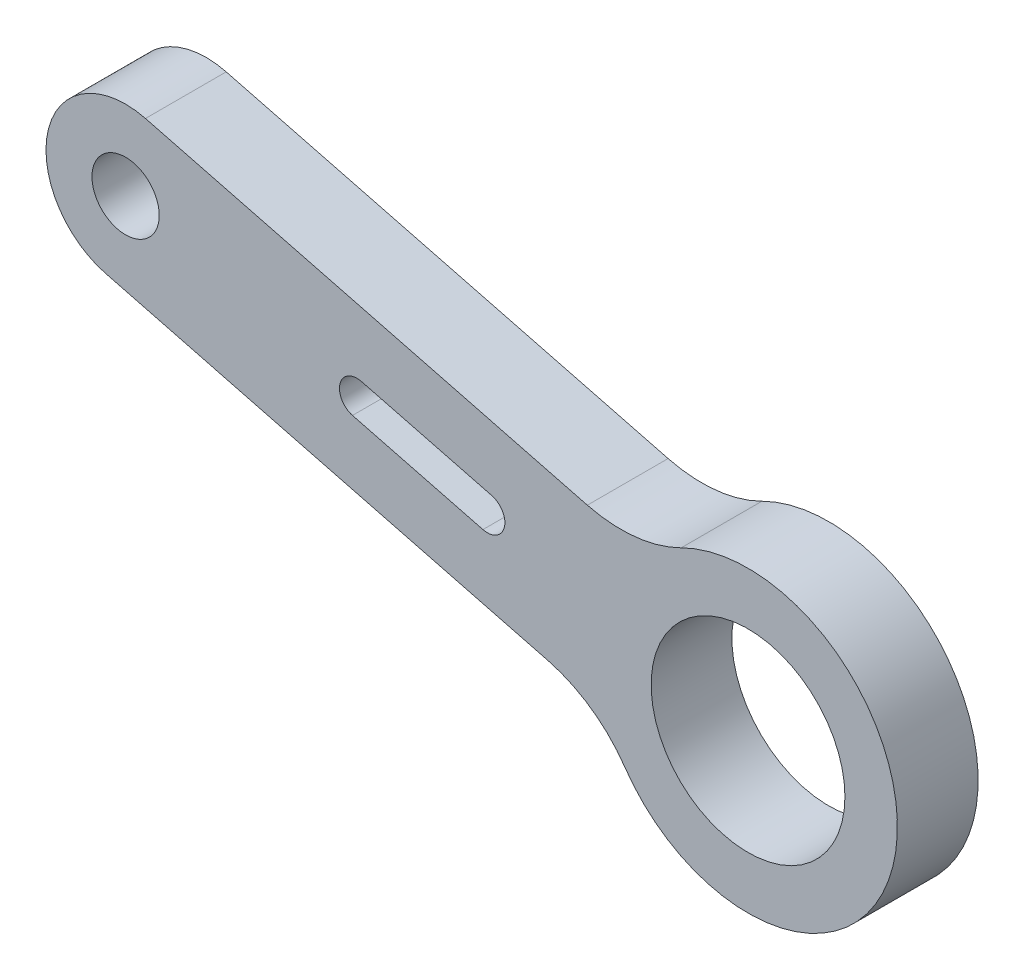
ISO-10303-21;
HEADER;
FILE_DESCRIPTION(('STEP AP214'),'2;1');
FILE_NAME('part.step','',(''),(''),'','','');
FILE_SCHEMA(('AUTOMOTIVE_DESIGN { 1 0 10303 214 1 1 1 1 }'));
ENDSEC;
DATA;
#1=APPLICATION_CONTEXT('core data for automotive mechanical design processes');
#2=APPLICATION_PROTOCOL_DEFINITION('international standard','automotive_design',2000,#1);
#3=PRODUCT_CONTEXT('',#1,'mechanical');
#4=PRODUCT('Part','Part','',(#3));
#5=PRODUCT_RELATED_PRODUCT_CATEGORY('part','',(#4));
#6=PRODUCT_DEFINITION_FORMATION('','',#4);
#7=PRODUCT_DEFINITION_CONTEXT('part definition',#1,'design');
#8=PRODUCT_DEFINITION('design','',#6,#7);
#9=PRODUCT_DEFINITION_SHAPE('','',#8);
#10=(LENGTH_UNIT() NAMED_UNIT(*) SI_UNIT(.MILLI.,.METRE.));
#11=(NAMED_UNIT(*) PLANE_ANGLE_UNIT() SI_UNIT($,.RADIAN.));
#12=(NAMED_UNIT(*) SI_UNIT($,.STERADIAN.) SOLID_ANGLE_UNIT());
#13=UNCERTAINTY_MEASURE_WITH_UNIT(LENGTH_MEASURE(1.E-05),#10,'distance_accuracy_value','');
#14=(GEOMETRIC_REPRESENTATION_CONTEXT(3) GLOBAL_UNCERTAINTY_ASSIGNED_CONTEXT((#13)) GLOBAL_UNIT_ASSIGNED_CONTEXT((#10,
#11,#12)) REPRESENTATION_CONTEXT('',''));
#15=CARTESIAN_POINT('',(0.,0.,0.));
#16=DIRECTION('',(0.,0.,1.));
#17=DIRECTION('',(1.,0.,0.));
#18=AXIS2_PLACEMENT_3D('',#15,#16,#17);
#19=CARTESIAN_POINT('',(2402.81383255118,1573.94765680587,3.));
#20=DIRECTION('',(0.,0.,1.));
#21=DIRECTION('',(1.,0.,0.));
#22=AXIS2_PLACEMENT_3D('',#19,#20,#21);
#23=PLANE('',#22);
#24=CARTESIAN_POINT('',(2425.93961174426,1567.98553067043,3.));
#25=DIRECTION('',(0.,0.,1.));
#26=DIRECTION('',(1.,0.,0.));
#27=AXIS2_PLACEMENT_3D('',#24,#25,#26);
#28=CIRCLE('',#27,3.60000000000009);
#29=CARTESIAN_POINT('',(2429.53961174426,1567.98553067043,3.));
#30=VERTEX_POINT('',#29);
#31=EDGE_CURVE('E173',#30,#30,#28,.T.);
#32=ORIENTED_EDGE('',*,*,#31,.F.);
#33=EDGE_LOOP('',(#32));
#34=FACE_BOUND('',#33,.T.);
#35=CARTESIAN_POINT('',(2402.81383255118,1573.94765680587,3.));
#36=DIRECTION('',(0.,0.,1.));
#37=DIRECTION('',(1.,0.,0.));
#38=AXIS2_PLACEMENT_3D('',#35,#36,#37);
#39=CIRCLE('',#38,2.95719087810332);
#40=CARTESIAN_POINT('',(2403.5520942306,1576.81121187202,3.));
#41=VERTEX_POINT('',#40);
#42=CARTESIAN_POINT('',(2402.07557087634,1571.08410175744,3.));
#43=VERTEX_POINT('',#42);
#44=EDGE_CURVE('E181',#41,#43,#39,.T.);
#45=ORIENTED_EDGE('',*,*,#44,.T.);
#46=DIRECTION('',(0.968336228034732,-0.249649653465547,0.));
#47=VECTOR('',#46,1.);
#48=CARTESIAN_POINT('',(2402.07557087634,1571.08410175744,3.));
#49=LINE('',#48,#47);
#50=CARTESIAN_POINT('',(2418.49353362662,1566.85133777262,3.));
#51=VERTEX_POINT('',#50);
#52=EDGE_CURVE('E184',#43,#51,#49,.T.);
#53=ORIENTED_EDGE('',*,*,#52,.T.);
#54=CARTESIAN_POINT('',(2417.24529104946,1562.00967870336,3.));
#55=DIRECTION('',(0.,0.,-1.));
#56=DIRECTION('',(-1.,0.,0.));
#57=AXIS2_PLACEMENT_3D('',#54,#55,#56);
#58=CIRCLE('',#57,4.99997720738516);
#59=CARTESIAN_POINT('',(2421.36581230303,1564.84182924195,3.));
#60=VERTEX_POINT('',#59);
#61=EDGE_CURVE('E188',#51,#60,#58,.T.);
#62=ORIENTED_EDGE('',*,*,#61,.T.);
#63=CARTESIAN_POINT('',(2425.93961174426,1567.98553067043,3.));
#64=DIRECTION('',(0.,0.,1.));
#65=DIRECTION('',(1.,0.,0.));
#66=AXIS2_PLACEMENT_3D('',#63,#64,#65);
#67=CIRCLE('',#66,5.55000000000014);
#68=CARTESIAN_POINT('',(2423.45586581194,1572.9487459734,3.));
#69=VERTEX_POINT('',#68);
#70=EDGE_CURVE('E191',#60,#69,#67,.T.);
#71=ORIENTED_EDGE('',*,*,#70,.T.);
#72=CARTESIAN_POINT('',(2421.21831043929,1577.4200040527,3.));
#73=DIRECTION('',(0.,0.,-1.));
#74=DIRECTION('',(1.,0.,0.));
#75=AXIS2_PLACEMENT_3D('',#72,#73,#74);
#76=CIRCLE('',#75,4.99988028430294);
#77=CARTESIAN_POINT('',(2419.97009205895,1572.57843883757,3.));
#78=VERTEX_POINT('',#77);
#79=EDGE_CURVE('E194',#69,#78,#76,.T.);
#80=ORIENTED_EDGE('',*,*,#79,.T.);
#81=DIRECTION('',(-0.968336227948475,0.24964965380012,0.));
#82=VECTOR('',#81,1.);
#83=CARTESIAN_POINT('',(2419.97009205895,1572.57843883757,3.));
#84=LINE('',#83,#82);
#85=EDGE_CURVE('E197',#78,#41,#84,.T.);
#86=ORIENTED_EDGE('',*,*,#85,.T.);
#87=EDGE_LOOP('',(#45,#53,#62,#71,#80,#86));
#88=FACE_BOUND('',#87,.T.);
#89=CARTESIAN_POINT('',(2402.81383255118,1573.94765680587,3.));
#90=DIRECTION('',(0.,0.,1.));
#91=DIRECTION('',(1.,0.,0.));
#92=AXIS2_PLACEMENT_3D('',#89,#90,#91);
#93=CIRCLE('',#92,1.25000000000008);
#94=CARTESIAN_POINT('',(2404.06383255118,1573.94765680587,3.));
#95=VERTEX_POINT('',#94);
#96=EDGE_CURVE('E165',#95,#95,#93,.T.);
#97=ORIENTED_EDGE('',*,*,#96,.F.);
#98=EDGE_LOOP('',(#97));
#99=FACE_BOUND('',#98,.T.);
#100=DIRECTION('',(-0.968336227494035,0.249649655562794,0.));
#101=VECTOR('',#100,1.);
#102=CARTESIAN_POINT('',(2416.42110482516,1571.11077223534,3.));
#103=LINE('',#102,#101);
#104=CARTESIAN_POINT('',(2416.42110482516,1571.11077223534,3.));
#105=VERTEX_POINT('',#104);
#106=CARTESIAN_POINT('',(2411.57455434921,1572.36027589186,3.));
#107=VERTEX_POINT('',#106);
#108=EDGE_CURVE('E126',#105,#107,#103,.T.);
#109=ORIENTED_EDGE('',*,*,#108,.F.);
#110=CARTESIAN_POINT('',(2416.25585019903,1570.48213012384,3.));
#111=DIRECTION('',(0.,0.,1.));
#112=DIRECTION('',(1.,0.,0.));
#113=AXIS2_PLACEMENT_3D('',#110,#111,#112);
#114=CIRCLE('',#113,0.649999996780892);
#115=CARTESIAN_POINT('',(2416.0905955729,1569.85348801233,3.));
#116=VERTEX_POINT('',#115);
#117=EDGE_CURVE('E117',#116,#105,#114,.T.);
#118=ORIENTED_EDGE('',*,*,#117,.F.);
#119=DIRECTION('',(0.968336228734659,-0.249649650750684,0.));
#120=VECTOR('',#119,1.);
#121=CARTESIAN_POINT('',(2411.24404686611,1571.10299118705,3.));
#122=LINE('',#121,#120);
#123=CARTESIAN_POINT('',(2411.24404686611,1571.10299118705,3.));
#124=VERTEX_POINT('',#123);
#125=EDGE_CURVE('E143',#124,#116,#122,.T.);
#126=ORIENTED_EDGE('',*,*,#125,.F.);
#127=CARTESIAN_POINT('',(2411.40930060766,1571.73163353945,3.));
#128=DIRECTION('',(0.,0.,1.));
#129=DIRECTION('',(1.,0.,0.));
#130=AXIS2_PLACEMENT_3D('',#127,#128,#129);
#131=CIRCLE('',#130,0.650000004871287);
#132=EDGE_CURVE('E139',#107,#124,#131,.T.);
#133=ORIENTED_EDGE('',*,*,#132,.F.);
#134=EDGE_LOOP('',(#109,#118,#126,#133));
#135=FACE_BOUND('',#134,.T.);
#136=ADVANCED_FACE('F39',(#34,#88,#99,#135),#23,.T.);
#137=CARTESIAN_POINT('',(2402.81383255118,1573.94765680587,0.));
#138=DIRECTION('',(0.,0.,1.));
#139=DIRECTION('',(1.,0.,0.));
#140=AXIS2_PLACEMENT_3D('',#137,#138,#139);
#141=PLANE('',#140);
#142=CARTESIAN_POINT('',(2402.81383255118,1573.94765680587,0.));
#143=DIRECTION('',(0.,0.,1.));
#144=DIRECTION('',(1.,0.,0.));
#145=AXIS2_PLACEMENT_3D('',#142,#143,#144);
#146=CIRCLE('',#145,1.25000000000008);
#147=CARTESIAN_POINT('',(2404.06383255118,1573.94765680587,0.));
#148=VERTEX_POINT('',#147);
#149=EDGE_CURVE('E135',#148,#148,#146,.T.);
#150=ORIENTED_EDGE('',*,*,#149,.T.);
#151=EDGE_LOOP('',(#150));
#152=FACE_BOUND('',#151,.T.);
#153=CARTESIAN_POINT('',(2425.93961174426,1567.98553067043,0.));
#154=DIRECTION('',(0.,0.,1.));
#155=DIRECTION('',(1.,0.,0.));
#156=AXIS2_PLACEMENT_3D('',#153,#154,#155);
#157=CIRCLE('',#156,3.60000000000009);
#158=CARTESIAN_POINT('',(2429.53961174426,1567.98553067043,0.));
#159=VERTEX_POINT('',#158);
#160=EDGE_CURVE('E169',#159,#159,#157,.T.);
#161=ORIENTED_EDGE('',*,*,#160,.T.);
#162=EDGE_LOOP('',(#161));
#163=FACE_BOUND('',#162,.T.);
#164=CARTESIAN_POINT('',(2402.81383255118,1573.94765680587,0.));
#165=DIRECTION('',(0.,0.,1.));
#166=DIRECTION('',(1.,0.,0.));
#167=AXIS2_PLACEMENT_3D('',#164,#165,#166);
#168=CIRCLE('',#167,2.95719086566255);
#169=CARTESIAN_POINT('',(2403.5520942306,1576.81121187202,0.));
#170=VERTEX_POINT('',#169);
#171=CARTESIAN_POINT('',(2402.07557087634,1571.08410175744,0.));
#172=VERTEX_POINT('',#171);
#173=EDGE_CURVE('E177',#170,#172,#168,.T.);
#174=ORIENTED_EDGE('',*,*,#173,.F.);
#175=DIRECTION('',(-0.968336227948475,0.24964965380012,0.));
#176=VECTOR('',#175,1.);
#177=CARTESIAN_POINT('',(2419.97009205895,1572.57843883757,0.));
#178=LINE('',#177,#176);
#179=CARTESIAN_POINT('',(2419.97009205895,1572.57843883757,0.));
#180=VERTEX_POINT('',#179);
#181=EDGE_CURVE('E185',#180,#170,#178,.T.);
#182=ORIENTED_EDGE('',*,*,#181,.F.);
#183=CARTESIAN_POINT('',(2421.21831043929,1577.4200040527,0.));
#184=DIRECTION('',(0.,0.,-1.));
#185=DIRECTION('',(1.,0.,0.));
#186=AXIS2_PLACEMENT_3D('',#183,#184,#185);
#187=CIRCLE('',#186,4.99988028430294);
#188=CARTESIAN_POINT('',(2423.45586581194,1572.9487459734,0.));
#189=VERTEX_POINT('',#188);
#190=EDGE_CURVE('E212',#189,#180,#187,.T.);
#191=ORIENTED_EDGE('',*,*,#190,.F.);
#192=CARTESIAN_POINT('',(2425.93961174426,1567.98553067043,0.));
#193=DIRECTION('',(0.,0.,1.));
#194=DIRECTION('',(1.,0.,0.));
#195=AXIS2_PLACEMENT_3D('',#192,#193,#194);
#196=CIRCLE('',#195,5.55000000000014);
#197=CARTESIAN_POINT('',(2421.36581230303,1564.84182924195,0.));
#198=VERTEX_POINT('',#197);
#199=EDGE_CURVE('E209',#198,#189,#196,.T.);
#200=ORIENTED_EDGE('',*,*,#199,.F.);
#201=CARTESIAN_POINT('',(2417.24529104946,1562.00967870336,0.));
#202=DIRECTION('',(0.,0.,-1.));
#203=DIRECTION('',(-1.,0.,0.));
#204=AXIS2_PLACEMENT_3D('',#201,#202,#203);
#205=CIRCLE('',#204,4.99997720738516);
#206=CARTESIAN_POINT('',(2418.49353362662,1566.85133777262,0.));
#207=VERTEX_POINT('',#206);
#208=EDGE_CURVE('E206',#207,#198,#205,.T.);
#209=ORIENTED_EDGE('',*,*,#208,.F.);
#210=DIRECTION('',(0.968336228034732,-0.249649653465547,0.));
#211=VECTOR('',#210,1.);
#212=CARTESIAN_POINT('',(2402.07557087634,1571.08410175744,0.));
#213=LINE('',#212,#211);
#214=EDGE_CURVE('E203',#172,#207,#213,.T.);
#215=ORIENTED_EDGE('',*,*,#214,.F.);
#216=EDGE_LOOP('',(#174,#182,#191,#200,#209,#215));
#217=FACE_BOUND('',#216,.T.);
#218=CARTESIAN_POINT('',(2416.25585019903,1570.48213012384,0.));
#219=DIRECTION('',(0.,0.,1.));
#220=DIRECTION('',(1.,0.,0.));
#221=AXIS2_PLACEMENT_3D('',#218,#219,#220);
#222=CIRCLE('',#221,0.649999996780892);
#223=CARTESIAN_POINT('',(2416.0905955729,1569.85348801233,0.));
#224=VERTEX_POINT('',#223);
#225=CARTESIAN_POINT('',(2416.42110482516,1571.11077223534,0.));
#226=VERTEX_POINT('',#225);
#227=EDGE_CURVE('E63',#224,#226,#222,.T.);
#228=ORIENTED_EDGE('',*,*,#227,.T.);
#229=DIRECTION('',(-0.968336227494035,0.249649655562794,0.));
#230=VECTOR('',#229,1.);
#231=CARTESIAN_POINT('',(2416.42110482516,1571.11077223534,0.));
#232=LINE('',#231,#230);
#233=CARTESIAN_POINT('',(2411.57455434921,1572.36027589186,0.));
#234=VERTEX_POINT('',#233);
#235=EDGE_CURVE('E133',#226,#234,#232,.T.);
#236=ORIENTED_EDGE('',*,*,#235,.T.);
#237=CARTESIAN_POINT('',(2411.40930060766,1571.73163353945,0.));
#238=DIRECTION('',(0.,0.,1.));
#239=DIRECTION('',(1.,0.,0.));
#240=AXIS2_PLACEMENT_3D('',#237,#238,#239);
#241=CIRCLE('',#240,0.650000004871287);
#242=CARTESIAN_POINT('',(2411.24404686611,1571.10299118705,0.));
#243=VERTEX_POINT('',#242);
#244=EDGE_CURVE('E152',#234,#243,#241,.T.);
#245=ORIENTED_EDGE('',*,*,#244,.T.);
#246=DIRECTION('',(0.968336228734659,-0.249649650750684,0.));
#247=VECTOR('',#246,1.);
#248=CARTESIAN_POINT('',(2411.24404686611,1571.10299118705,0.));
#249=LINE('',#248,#247);
#250=EDGE_CURVE('E127',#243,#224,#249,.T.);
#251=ORIENTED_EDGE('',*,*,#250,.T.);
#252=EDGE_LOOP('',(#228,#236,#245,#251));
#253=FACE_BOUND('',#252,.T.);
#254=ADVANCED_FACE('F245',(#152,#163,#217,#253),#141,.F.);
#255=CARTESIAN_POINT('',(2402.81383255118,1573.94765680587,3.));
#256=DIRECTION('',(0.,0.,-1.));
#257=DIRECTION('',(-1.,0.,0.));
#258=AXIS2_PLACEMENT_3D('',#255,#256,#257);
#259=CYLINDRICAL_SURFACE('',#258,2.95719086566255);
#260=ORIENTED_EDGE('',*,*,#173,.T.);
#261=DIRECTION('',(0.,0.,-1.));
#262=VECTOR('',#261,1.);
#263=CARTESIAN_POINT('',(2402.07557087634,1571.08410175744,3.));
#264=LINE('',#263,#262);
#265=EDGE_CURVE('E11',#43,#172,#264,.T.);
#266=ORIENTED_EDGE('',*,*,#265,.F.);
#267=ORIENTED_EDGE('',*,*,#44,.F.);
#268=DIRECTION('',(0.,0.,-1.));
#269=VECTOR('',#268,1.);
#270=CARTESIAN_POINT('',(2403.5520942306,1576.81121187202,3.));
#271=LINE('',#270,#269);
#272=EDGE_CURVE('E200',#41,#170,#271,.T.);
#273=ORIENTED_EDGE('',*,*,#272,.T.);
#274=EDGE_LOOP('',(#260,#266,#267,#273));
#275=FACE_BOUND('',#274,.T.);
#276=ADVANCED_FACE('F41',(#275),#259,.T.);
#277=CARTESIAN_POINT('',(2402.07557087634,1571.08410175744,3.));
#278=DIRECTION('',(0.249649653465547,0.968336228034732,0.));
#279=DIRECTION('',(-0.968336228034732,0.249649653465547,0.));
#280=AXIS2_PLACEMENT_3D('',#277,#278,#279);
#281=PLANE('',#280);
#282=ORIENTED_EDGE('',*,*,#214,.T.);
#283=DIRECTION('',(0.,0.,-1.));
#284=VECTOR('',#283,1.);
#285=CARTESIAN_POINT('',(2418.49353362662,1566.85133777262,3.));
#286=LINE('',#285,#284);
#287=EDGE_CURVE('E48',#51,#207,#286,.T.);
#288=ORIENTED_EDGE('',*,*,#287,.F.);
#289=ORIENTED_EDGE('',*,*,#52,.F.);
#290=ORIENTED_EDGE('',*,*,#265,.T.);
#291=EDGE_LOOP('',(#282,#288,#289,#290));
#292=FACE_BOUND('',#291,.T.);
#293=ADVANCED_FACE('F263',(#292),#281,.F.);
#294=CARTESIAN_POINT('',(2417.24529104946,1562.00967870336,3.));
#295=DIRECTION('',(0.,0.,-1.));
#296=DIRECTION('',(-1.,0.,0.));
#297=AXIS2_PLACEMENT_3D('',#294,#295,#296);
#298=CYLINDRICAL_SURFACE('',#297,4.99997720738516);
#299=ORIENTED_EDGE('',*,*,#208,.T.);
#300=DIRECTION('',(0.,0.,-1.));
#301=VECTOR('',#300,1.);
#302=CARTESIAN_POINT('',(2421.36581230303,1564.84182924195,3.));
#303=LINE('',#302,#301);
#304=EDGE_CURVE('E229',#60,#198,#303,.T.);
#305=ORIENTED_EDGE('',*,*,#304,.F.);
#306=ORIENTED_EDGE('',*,*,#61,.F.);
#307=ORIENTED_EDGE('',*,*,#287,.T.);
#308=EDGE_LOOP('',(#299,#305,#306,#307));
#309=FACE_BOUND('',#308,.T.);
#310=ADVANCED_FACE('F238',(#309),#298,.F.);
#311=CARTESIAN_POINT('',(2425.93961174426,1567.98553067043,3.));
#312=DIRECTION('',(0.,0.,-1.));
#313=DIRECTION('',(-1.,0.,0.));
#314=AXIS2_PLACEMENT_3D('',#311,#312,#313);
#315=CYLINDRICAL_SURFACE('',#314,5.55000000000014);
#316=ORIENTED_EDGE('',*,*,#199,.T.);
#317=DIRECTION('',(0.,0.,-1.));
#318=VECTOR('',#317,1.);
#319=CARTESIAN_POINT('',(2423.45586581194,1572.9487459734,3.));
#320=LINE('',#319,#318);
#321=EDGE_CURVE('E225',#69,#189,#320,.T.);
#322=ORIENTED_EDGE('',*,*,#321,.F.);
#323=ORIENTED_EDGE('',*,*,#70,.F.);
#324=ORIENTED_EDGE('',*,*,#304,.T.);
#325=EDGE_LOOP('',(#316,#322,#323,#324));
#326=FACE_BOUND('',#325,.T.);
#327=ADVANCED_FACE('F251',(#326),#315,.T.);
#328=CARTESIAN_POINT('',(2421.21831043929,1577.4200040527,3.));
#329=DIRECTION('',(0.,0.,-1.));
#330=DIRECTION('',(-1.,0.,0.));
#331=AXIS2_PLACEMENT_3D('',#328,#329,#330);
#332=CYLINDRICAL_SURFACE('',#331,4.99988028430294);
#333=ORIENTED_EDGE('',*,*,#190,.T.);
#334=DIRECTION('',(0.,0.,-1.));
#335=VECTOR('',#334,1.);
#336=CARTESIAN_POINT('',(2419.97009205895,1572.57843883757,3.));
#337=LINE('',#336,#335);
#338=EDGE_CURVE('E221',#78,#180,#337,.T.);
#339=ORIENTED_EDGE('',*,*,#338,.F.);
#340=ORIENTED_EDGE('',*,*,#79,.F.);
#341=ORIENTED_EDGE('',*,*,#321,.T.);
#342=EDGE_LOOP('',(#333,#339,#340,#341));
#343=FACE_BOUND('',#342,.T.);
#344=ADVANCED_FACE('F255',(#343),#332,.F.);
#345=CARTESIAN_POINT('',(2419.97009205895,1572.57843883757,3.));
#346=DIRECTION('',(-0.24964965380012,-0.968336227948474,0.));
#347=DIRECTION('',(0.968336227948475,-0.24964965380012,0.));
#348=AXIS2_PLACEMENT_3D('',#345,#346,#347);
#349=PLANE('',#348);
#350=ORIENTED_EDGE('',*,*,#181,.T.);
#351=ORIENTED_EDGE('',*,*,#272,.F.);
#352=ORIENTED_EDGE('',*,*,#85,.F.);
#353=ORIENTED_EDGE('',*,*,#338,.T.);
#354=EDGE_LOOP('',(#350,#351,#352,#353));
#355=FACE_BOUND('',#354,.T.);
#356=ADVANCED_FACE('F266',(#355),#349,.F.);
#357=CARTESIAN_POINT('',(2425.93961174426,1567.98553067043,3.));
#358=DIRECTION('',(0.,0.,-1.));
#359=DIRECTION('',(-1.,0.,0.));
#360=AXIS2_PLACEMENT_3D('',#357,#358,#359);
#361=CYLINDRICAL_SURFACE('',#360,3.60000000000009);
#362=ORIENTED_EDGE('',*,*,#31,.T.);
#363=EDGE_LOOP('',(#362));
#364=FACE_BOUND('',#363,.T.);
#365=ORIENTED_EDGE('',*,*,#160,.F.);
#366=EDGE_LOOP('',(#365));
#367=FACE_BOUND('',#366,.T.);
#368=ADVANCED_FACE('F268',(#364,#367),#361,.F.);
#369=CARTESIAN_POINT('',(2402.81383255118,1573.94765680587,3.));
#370=DIRECTION('',(0.,0.,-1.));
#371=DIRECTION('',(-1.,0.,0.));
#372=AXIS2_PLACEMENT_3D('',#369,#370,#371);
#373=CYLINDRICAL_SURFACE('',#372,1.25000000000008);
#374=ORIENTED_EDGE('',*,*,#96,.T.);
#375=EDGE_LOOP('',(#374));
#376=FACE_BOUND('',#375,.T.);
#377=ORIENTED_EDGE('',*,*,#149,.F.);
#378=EDGE_LOOP('',(#377));
#379=FACE_BOUND('',#378,.T.);
#380=ADVANCED_FACE('F274',(#376,#379),#373,.F.);
#381=CARTESIAN_POINT('',(2416.25585019903,1570.48213012384,3.));
#382=DIRECTION('',(0.,0.,-1.));
#383=DIRECTION('',(-1.,0.,0.));
#384=AXIS2_PLACEMENT_3D('',#381,#382,#383);
#385=CYLINDRICAL_SURFACE('',#384,0.649999996780892);
#386=ORIENTED_EDGE('',*,*,#227,.F.);
#387=DIRECTION('',(0.,0.,-1.));
#388=VECTOR('',#387,1.);
#389=CARTESIAN_POINT('',(2416.0905955729,1569.85348801233,3.));
#390=LINE('',#389,#388);
#391=EDGE_CURVE('E121',#116,#224,#390,.T.);
#392=ORIENTED_EDGE('',*,*,#391,.F.);
#393=ORIENTED_EDGE('',*,*,#117,.T.);
#394=DIRECTION('',(0.,0.,-1.));
#395=VECTOR('',#394,1.);
#396=CARTESIAN_POINT('',(2416.42110482516,1571.11077223534,3.));
#397=LINE('',#396,#395);
#398=EDGE_CURVE('E120',#105,#226,#397,.T.);
#399=ORIENTED_EDGE('',*,*,#398,.T.);
#400=EDGE_LOOP('',(#386,#392,#393,#399));
#401=FACE_BOUND('',#400,.T.);
#402=ADVANCED_FACE('F119',(#401),#385,.F.);
#403=CARTESIAN_POINT('',(2416.42110482516,1571.11077223534,3.));
#404=DIRECTION('',(-0.249649655562794,-0.968336227494034,0.));
#405=DIRECTION('',(0.968336227494034,-0.249649655562794,0.));
#406=AXIS2_PLACEMENT_3D('',#403,#404,#405);
#407=PLANE('',#406);
#408=ORIENTED_EDGE('',*,*,#235,.F.);
#409=ORIENTED_EDGE('',*,*,#398,.F.);
#410=ORIENTED_EDGE('',*,*,#108,.T.);
#411=DIRECTION('',(0.,0.,-1.));
#412=VECTOR('',#411,1.);
#413=CARTESIAN_POINT('',(2411.57455434921,1572.36027589186,3.));
#414=LINE('',#413,#412);
#415=EDGE_CURVE('E136',#107,#234,#414,.T.);
#416=ORIENTED_EDGE('',*,*,#415,.T.);
#417=EDGE_LOOP('',(#408,#409,#410,#416));
#418=FACE_BOUND('',#417,.T.);
#419=ADVANCED_FACE('F130',(#418),#407,.T.);
#420=CARTESIAN_POINT('',(2411.40930060766,1571.73163353945,3.));
#421=DIRECTION('',(0.,0.,-1.));
#422=DIRECTION('',(-1.,0.,0.));
#423=AXIS2_PLACEMENT_3D('',#420,#421,#422);
#424=CYLINDRICAL_SURFACE('',#423,0.650000004871287);
#425=ORIENTED_EDGE('',*,*,#244,.F.);
#426=ORIENTED_EDGE('',*,*,#415,.F.);
#427=ORIENTED_EDGE('',*,*,#132,.T.);
#428=DIRECTION('',(0.,0.,-1.));
#429=VECTOR('',#428,1.);
#430=CARTESIAN_POINT('',(2411.24404686611,1571.10299118705,3.));
#431=LINE('',#430,#429);
#432=EDGE_CURVE('E55',#124,#243,#431,.T.);
#433=ORIENTED_EDGE('',*,*,#432,.T.);
#434=EDGE_LOOP('',(#425,#426,#427,#433));
#435=FACE_BOUND('',#434,.T.);
#436=ADVANCED_FACE('F295',(#435),#424,.F.);
#437=CARTESIAN_POINT('',(2411.24404686611,1571.10299118705,3.));
#438=DIRECTION('',(0.249649650750684,0.968336228734659,0.));
#439=DIRECTION('',(-0.968336228734659,0.249649650750684,0.));
#440=AXIS2_PLACEMENT_3D('',#437,#438,#439);
#441=PLANE('',#440);
#442=ORIENTED_EDGE('',*,*,#250,.F.);
#443=ORIENTED_EDGE('',*,*,#432,.F.);
#444=ORIENTED_EDGE('',*,*,#125,.T.);
#445=ORIENTED_EDGE('',*,*,#391,.T.);
#446=EDGE_LOOP('',(#442,#443,#444,#445));
#447=FACE_BOUND('',#446,.T.);
#448=ADVANCED_FACE('F298',(#447),#441,.T.);
#449=CLOSED_SHELL('',(#136,#254,#276,#293,#310,#327,#344,#356,#368,#380,#402,#419,#436,#448));
#450=MANIFOLD_SOLID_BREP('B2',#449);
#451=ADVANCED_BREP_SHAPE_REPRESENTATION('',(#18,#450),#14);
#452=SHAPE_DEFINITION_REPRESENTATION(#9,#451);
ENDSEC;
END-ISO-10303-21;
